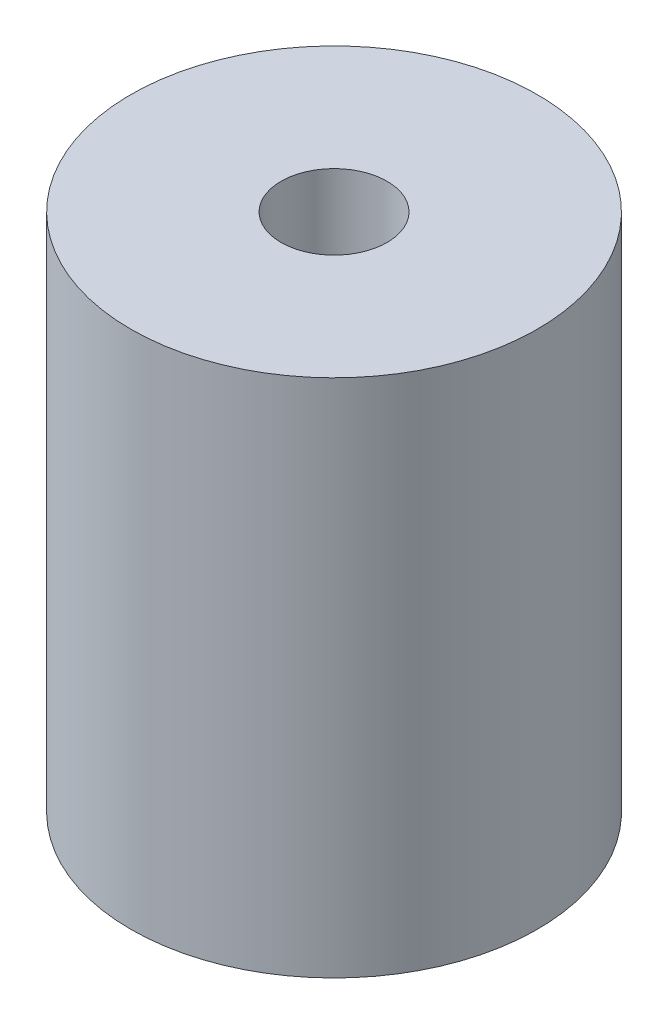
ISO-10303-21;
HEADER;
FILE_DESCRIPTION(('STEP AP214'),'2;1');
FILE_NAME('part.step','',(''),(''),'','','');
FILE_SCHEMA(('AUTOMOTIVE_DESIGN { 1 0 10303 214 1 1 1 1 }'));
ENDSEC;
DATA;
#1=APPLICATION_CONTEXT('core data for automotive mechanical design processes');
#2=APPLICATION_PROTOCOL_DEFINITION('international standard','automotive_design',2000,#1);
#3=PRODUCT_CONTEXT('',#1,'mechanical');
#4=PRODUCT('Part','Part','',(#3));
#5=PRODUCT_RELATED_PRODUCT_CATEGORY('part','',(#4));
#6=PRODUCT_DEFINITION_FORMATION('','',#4);
#7=PRODUCT_DEFINITION_CONTEXT('part definition',#1,'design');
#8=PRODUCT_DEFINITION('design','',#6,#7);
#9=PRODUCT_DEFINITION_SHAPE('','',#8);
#10=(LENGTH_UNIT() NAMED_UNIT(*) SI_UNIT(.MILLI.,.METRE.));
#11=(NAMED_UNIT(*) PLANE_ANGLE_UNIT() SI_UNIT($,.RADIAN.));
#12=(NAMED_UNIT(*) SI_UNIT($,.STERADIAN.) SOLID_ANGLE_UNIT());
#13=UNCERTAINTY_MEASURE_WITH_UNIT(LENGTH_MEASURE(1.E-05),#10,'distance_accuracy_value','');
#14=(GEOMETRIC_REPRESENTATION_CONTEXT(3) GLOBAL_UNCERTAINTY_ASSIGNED_CONTEXT((#13)) GLOBAL_UNIT_ASSIGNED_CONTEXT((#10,
#11,#12)) REPRESENTATION_CONTEXT('',''));
#15=CARTESIAN_POINT('',(0.,0.,0.));
#16=DIRECTION('',(0.,0.,1.));
#17=DIRECTION('',(1.,0.,0.));
#18=AXIS2_PLACEMENT_3D('',#15,#16,#17);
#19=CARTESIAN_POINT('',(0.,0.,0.));
#20=DIRECTION('',(0.,1.,0.));
#21=DIRECTION('',(0.,0.,1.));
#22=AXIS2_PLACEMENT_3D('',#19,#20,#21);
#23=PLANE('',#22);
#24=CARTESIAN_POINT('',(0.,0.,0.));
#25=DIRECTION('',(0.,1.,0.));
#26=DIRECTION('',(0.,0.,1.));
#27=AXIS2_PLACEMENT_3D('',#24,#25,#26);
#28=CIRCLE('',#27,9.58);
#29=CARTESIAN_POINT('',(0.,0.,9.58));
#30=VERTEX_POINT('',#29);
#31=EDGE_CURVE('E10',#30,#30,#28,.T.);
#32=ORIENTED_EDGE('',*,*,#31,.F.);
#33=EDGE_LOOP('',(#32));
#34=FACE_BOUND('',#33,.T.);
#35=CARTESIAN_POINT('',(0.,0.,0.));
#36=DIRECTION('',(0.,1.,0.));
#37=DIRECTION('',(0.,0.,1.));
#38=AXIS2_PLACEMENT_3D('',#35,#36,#37);
#39=CIRCLE('',#38,4.);
#40=CARTESIAN_POINT('',(0.,0.,4.));
#41=VERTEX_POINT('',#40);
#42=EDGE_CURVE('E37',#41,#41,#39,.T.);
#43=ORIENTED_EDGE('',*,*,#42,.T.);
#44=EDGE_LOOP('',(#43));
#45=FACE_BOUND('',#44,.T.);
#46=ADVANCED_FACE('F30',(#34,#45),#23,.F.);
#47=CARTESIAN_POINT('',(0.,18.,0.));
#48=DIRECTION('',(0.,-1.,0.));
#49=DIRECTION('',(0.,0.,-1.));
#50=AXIS2_PLACEMENT_3D('',#47,#48,#49);
#51=CYLINDRICAL_SURFACE('',#50,9.58);
#52=ORIENTED_EDGE('',*,*,#31,.T.);
#53=EDGE_LOOP('',(#52));
#54=FACE_BOUND('',#53,.T.);
#55=CARTESIAN_POINT('',(0.,24.5,0.));
#56=DIRECTION('',(0.,1.,0.));
#57=DIRECTION('',(0.,0.,1.));
#58=AXIS2_PLACEMENT_3D('',#55,#56,#57);
#59=CIRCLE('',#58,9.58);
#60=CARTESIAN_POINT('',(0.,24.5,9.58));
#61=VERTEX_POINT('',#60);
#62=EDGE_CURVE('E45',#61,#61,#59,.T.);
#63=ORIENTED_EDGE('',*,*,#62,.F.);
#64=EDGE_LOOP('',(#63));
#65=FACE_BOUND('',#64,.T.);
#66=ADVANCED_FACE('F32',(#54,#65),#51,.T.);
#67=CARTESIAN_POINT('',(0.,18.,0.));
#68=DIRECTION('',(0.,-1.,0.));
#69=DIRECTION('',(0.,0.,-1.));
#70=AXIS2_PLACEMENT_3D('',#67,#68,#69);
#71=CYLINDRICAL_SURFACE('',#70,4.);
#72=CARTESIAN_POINT('',(0.,18.,0.));
#73=DIRECTION('',(0.,1.,0.));
#74=DIRECTION('',(0.,0.,1.));
#75=AXIS2_PLACEMENT_3D('',#72,#73,#74);
#76=CIRCLE('',#75,4.);
#77=CARTESIAN_POINT('',(0.,18.,4.));
#78=VERTEX_POINT('',#77);
#79=EDGE_CURVE('E41',#78,#78,#76,.T.);
#80=ORIENTED_EDGE('',*,*,#79,.T.);
#81=EDGE_LOOP('',(#80));
#82=FACE_BOUND('',#81,.T.);
#83=ORIENTED_EDGE('',*,*,#42,.F.);
#84=EDGE_LOOP('',(#83));
#85=FACE_BOUND('',#84,.T.);
#86=ADVANCED_FACE('F70',(#82,#85),#71,.F.);
#87=CARTESIAN_POINT('',(0.,18.,0.));
#88=DIRECTION('',(0.,1.,0.));
#89=DIRECTION('',(0.,0.,1.));
#90=AXIS2_PLACEMENT_3D('',#87,#88,#89);
#91=PLANE('',#90);
#92=CARTESIAN_POINT('',(0.,18.,0.));
#93=DIRECTION('',(0.,1.,0.));
#94=DIRECTION('',(0.,0.,1.));
#95=AXIS2_PLACEMENT_3D('',#92,#93,#94);
#96=CIRCLE('',#95,2.5);
#97=CARTESIAN_POINT('',(0.,18.,2.5));
#98=VERTEX_POINT('',#97);
#99=EDGE_CURVE('E51',#98,#98,#96,.T.);
#100=ORIENTED_EDGE('',*,*,#99,.T.);
#101=EDGE_LOOP('',(#100));
#102=FACE_BOUND('',#101,.T.);
#103=ORIENTED_EDGE('',*,*,#79,.F.);
#104=EDGE_LOOP('',(#103));
#105=FACE_BOUND('',#104,.T.);
#106=ADVANCED_FACE('F62',(#102,#105),#91,.F.);
#107=CARTESIAN_POINT('',(0.,24.5,0.));
#108=DIRECTION('',(0.,1.,0.));
#109=DIRECTION('',(0.,0.,1.));
#110=AXIS2_PLACEMENT_3D('',#107,#108,#109);
#111=PLANE('',#110);
#112=ORIENTED_EDGE('',*,*,#62,.T.);
#113=EDGE_LOOP('',(#112));
#114=FACE_BOUND('',#113,.T.);
#115=CARTESIAN_POINT('',(0.,24.5,0.));
#116=DIRECTION('',(0.,1.,0.));
#117=DIRECTION('',(0.,0.,1.));
#118=AXIS2_PLACEMENT_3D('',#115,#116,#117);
#119=CIRCLE('',#118,2.5);
#120=CARTESIAN_POINT('',(0.,24.5,2.5));
#121=VERTEX_POINT('',#120);
#122=EDGE_CURVE('E50',#121,#121,#119,.T.);
#123=ORIENTED_EDGE('',*,*,#122,.F.);
#124=EDGE_LOOP('',(#123));
#125=FACE_BOUND('',#124,.T.);
#126=ADVANCED_FACE('F60',(#114,#125),#111,.T.);
#127=CARTESIAN_POINT('',(0.,24.5,0.));
#128=DIRECTION('',(0.,-1.,0.));
#129=DIRECTION('',(0.,0.,-1.));
#130=AXIS2_PLACEMENT_3D('',#127,#128,#129);
#131=CYLINDRICAL_SURFACE('',#130,2.5);
#132=ORIENTED_EDGE('',*,*,#122,.T.);
#133=EDGE_LOOP('',(#132));
#134=FACE_BOUND('',#133,.T.);
#135=ORIENTED_EDGE('',*,*,#99,.F.);
#136=EDGE_LOOP('',(#135));
#137=FACE_BOUND('',#136,.T.);
#138=ADVANCED_FACE('F57',(#134,#137),#131,.F.);
#139=CLOSED_SHELL('',(#46,#66,#86,#106,#126,#138));
#140=MANIFOLD_SOLID_BREP('B2',#139);
#141=ADVANCED_BREP_SHAPE_REPRESENTATION('',(#18,#140),#14);
#142=SHAPE_DEFINITION_REPRESENTATION(#9,#141);
ENDSEC;
END-ISO-10303-21;
